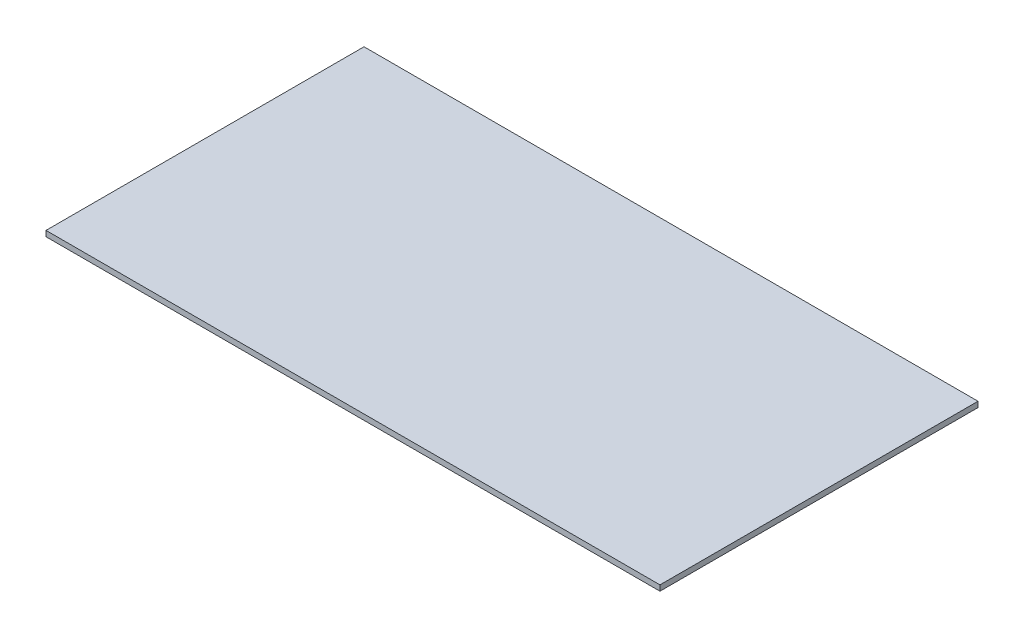
ISO-10303-21;
HEADER;
FILE_DESCRIPTION(('STEP AP214'),'2;1');
FILE_NAME('part.step','',(''),(''),'','','');
FILE_SCHEMA(('AUTOMOTIVE_DESIGN { 1 0 10303 214 1 1 1 1 }'));
ENDSEC;
DATA;
#1=APPLICATION_CONTEXT('core data for automotive mechanical design processes');
#2=APPLICATION_PROTOCOL_DEFINITION('international standard','automotive_design',2000,#1);
#3=PRODUCT_CONTEXT('',#1,'mechanical');
#4=PRODUCT('Part','Part','',(#3));
#5=PRODUCT_RELATED_PRODUCT_CATEGORY('part','',(#4));
#6=PRODUCT_DEFINITION_FORMATION('','',#4);
#7=PRODUCT_DEFINITION_CONTEXT('part definition',#1,'design');
#8=PRODUCT_DEFINITION('design','',#6,#7);
#9=PRODUCT_DEFINITION_SHAPE('','',#8);
#10=(LENGTH_UNIT() NAMED_UNIT(*) SI_UNIT(.MILLI.,.METRE.));
#11=(NAMED_UNIT(*) PLANE_ANGLE_UNIT() SI_UNIT($,.RADIAN.));
#12=(NAMED_UNIT(*) SI_UNIT($,.STERADIAN.) SOLID_ANGLE_UNIT());
#13=UNCERTAINTY_MEASURE_WITH_UNIT(LENGTH_MEASURE(1.E-05),#10,'distance_accuracy_value','');
#14=(GEOMETRIC_REPRESENTATION_CONTEXT(3) GLOBAL_UNCERTAINTY_ASSIGNED_CONTEXT((#13)) GLOBAL_UNIT_ASSIGNED_CONTEXT((#10,
#11,#12)) REPRESENTATION_CONTEXT('',''));
#15=CARTESIAN_POINT('',(0.,0.,0.));
#16=DIRECTION('',(0.,0.,1.));
#17=DIRECTION('',(1.,0.,0.));
#18=AXIS2_PLACEMENT_3D('',#15,#16,#17);
#19=CARTESIAN_POINT('',(0.,1.8,0.));
#20=DIRECTION('',(1.,0.,0.));
#21=DIRECTION('',(0.,0.,-1.));
#22=AXIS2_PLACEMENT_3D('',#19,#20,#21);
#23=PLANE('',#22);
#24=DIRECTION('',(0.,0.,1.));
#25=VECTOR('',#24,1.);
#26=CARTESIAN_POINT('',(0.,0.,0.));
#27=LINE('',#26,#25);
#28=CARTESIAN_POINT('',(0.,0.,-103.6));
#29=VERTEX_POINT('',#28);
#30=CARTESIAN_POINT('',(0.,0.,0.));
#31=VERTEX_POINT('',#30);
#32=EDGE_CURVE('E98',#29,#31,#27,.T.);
#33=ORIENTED_EDGE('',*,*,#32,.T.);
#34=DIRECTION('',(0.,-1.,0.));
#35=VECTOR('',#34,1.);
#36=CARTESIAN_POINT('',(0.,1.8,0.));
#37=LINE('',#36,#35);
#38=CARTESIAN_POINT('',(0.,1.8,0.));
#39=VERTEX_POINT('',#38);
#40=EDGE_CURVE('E11',#39,#31,#37,.T.);
#41=ORIENTED_EDGE('',*,*,#40,.F.);
#42=DIRECTION('',(0.,0.,1.));
#43=VECTOR('',#42,1.);
#44=CARTESIAN_POINT('',(0.,1.8,0.));
#45=LINE('',#44,#43);
#46=CARTESIAN_POINT('',(0.,1.8,-103.6));
#47=VERTEX_POINT('',#46);
#48=EDGE_CURVE('E86',#47,#39,#45,.T.);
#49=ORIENTED_EDGE('',*,*,#48,.F.);
#50=DIRECTION('',(0.,-1.,0.));
#51=VECTOR('',#50,1.);
#52=CARTESIAN_POINT('',(0.,1.8,-103.6));
#53=LINE('',#52,#51);
#54=EDGE_CURVE('E94',#47,#29,#53,.T.);
#55=ORIENTED_EDGE('',*,*,#54,.T.);
#56=EDGE_LOOP('',(#33,#41,#49,#55));
#57=FACE_BOUND('',#56,.T.);
#58=ADVANCED_FACE('F35',(#57),#23,.F.);
#59=CARTESIAN_POINT('',(0.,1.8,0.));
#60=DIRECTION('',(0.,0.,-1.));
#61=DIRECTION('',(-1.,0.,0.));
#62=AXIS2_PLACEMENT_3D('',#59,#60,#61);
#63=PLANE('',#62);
#64=DIRECTION('',(1.,0.,0.));
#65=VECTOR('',#64,1.);
#66=CARTESIAN_POINT('',(0.,0.,0.));
#67=LINE('',#66,#65);
#68=CARTESIAN_POINT('',(200.,0.,0.));
#69=VERTEX_POINT('',#68);
#70=EDGE_CURVE('E90',#31,#69,#67,.T.);
#71=ORIENTED_EDGE('',*,*,#70,.T.);
#72=DIRECTION('',(0.,-1.,0.));
#73=VECTOR('',#72,1.);
#74=CARTESIAN_POINT('',(200.,1.8,0.));
#75=LINE('',#74,#73);
#76=CARTESIAN_POINT('',(200.,1.8,0.));
#77=VERTEX_POINT('',#76);
#78=EDGE_CURVE('E43',#77,#69,#75,.T.);
#79=ORIENTED_EDGE('',*,*,#78,.F.);
#80=DIRECTION('',(1.,0.,0.));
#81=VECTOR('',#80,1.);
#82=CARTESIAN_POINT('',(0.,1.8,0.));
#83=LINE('',#82,#81);
#84=EDGE_CURVE('E81',#39,#77,#83,.T.);
#85=ORIENTED_EDGE('',*,*,#84,.F.);
#86=ORIENTED_EDGE('',*,*,#40,.T.);
#87=EDGE_LOOP('',(#71,#79,#85,#86));
#88=FACE_BOUND('',#87,.T.);
#89=ADVANCED_FACE('F89',(#88),#63,.F.);
#90=CARTESIAN_POINT('',(200.,1.8,0.));
#91=DIRECTION('',(-1.,0.,0.));
#92=DIRECTION('',(0.,0.,1.));
#93=AXIS2_PLACEMENT_3D('',#90,#91,#92);
#94=PLANE('',#93);
#95=DIRECTION('',(0.,0.,-1.));
#96=VECTOR('',#95,1.);
#97=CARTESIAN_POINT('',(200.,0.,0.));
#98=LINE('',#97,#96);
#99=CARTESIAN_POINT('',(200.,0.,-103.6));
#100=VERTEX_POINT('',#99);
#101=EDGE_CURVE('E68',#69,#100,#98,.T.);
#102=ORIENTED_EDGE('',*,*,#101,.T.);
#103=DIRECTION('',(0.,-1.,0.));
#104=VECTOR('',#103,1.);
#105=CARTESIAN_POINT('',(200.,1.8,-103.6));
#106=LINE('',#105,#104);
#107=CARTESIAN_POINT('',(200.,1.8,-103.6));
#108=VERTEX_POINT('',#107);
#109=EDGE_CURVE('E91',#108,#100,#106,.T.);
#110=ORIENTED_EDGE('',*,*,#109,.F.);
#111=DIRECTION('',(0.,0.,-1.));
#112=VECTOR('',#111,1.);
#113=CARTESIAN_POINT('',(200.,1.8,0.));
#114=LINE('',#113,#112);
#115=EDGE_CURVE('E84',#77,#108,#114,.T.);
#116=ORIENTED_EDGE('',*,*,#115,.F.);
#117=ORIENTED_EDGE('',*,*,#78,.T.);
#118=EDGE_LOOP('',(#102,#110,#116,#117));
#119=FACE_BOUND('',#118,.T.);
#120=ADVANCED_FACE('F92',(#119),#94,.F.);
#121=CARTESIAN_POINT('',(0.,1.8,-103.6));
#122=DIRECTION('',(0.,0.,1.));
#123=DIRECTION('',(1.,0.,0.));
#124=AXIS2_PLACEMENT_3D('',#121,#122,#123);
#125=PLANE('',#124);
#126=DIRECTION('',(-1.,0.,0.));
#127=VECTOR('',#126,1.);
#128=CARTESIAN_POINT('',(0.,0.,-103.6));
#129=LINE('',#128,#127);
#130=EDGE_CURVE('E74',#100,#29,#129,.T.);
#131=ORIENTED_EDGE('',*,*,#130,.T.);
#132=ORIENTED_EDGE('',*,*,#54,.F.);
#133=DIRECTION('',(-1.,0.,0.));
#134=VECTOR('',#133,1.);
#135=CARTESIAN_POINT('',(0.,1.8,-103.6));
#136=LINE('',#135,#134);
#137=EDGE_CURVE('E51',#108,#47,#136,.T.);
#138=ORIENTED_EDGE('',*,*,#137,.F.);
#139=ORIENTED_EDGE('',*,*,#109,.T.);
#140=EDGE_LOOP('',(#131,#132,#138,#139));
#141=FACE_BOUND('',#140,.T.);
#142=ADVANCED_FACE('F105',(#141),#125,.F.);
#143=CARTESIAN_POINT('',(0.,1.8,0.));
#144=DIRECTION('',(0.,-1.,0.));
#145=DIRECTION('',(0.,0.,-1.));
#146=AXIS2_PLACEMENT_3D('',#143,#144,#145);
#147=PLANE('',#146);
#148=ORIENTED_EDGE('',*,*,#48,.T.);
#149=ORIENTED_EDGE('',*,*,#84,.T.);
#150=ORIENTED_EDGE('',*,*,#115,.T.);
#151=ORIENTED_EDGE('',*,*,#137,.T.);
#152=EDGE_LOOP('',(#148,#149,#150,#151));
#153=FACE_BOUND('',#152,.T.);
#154=ADVANCED_FACE('F82',(#153),#147,.F.);
#155=CARTESIAN_POINT('',(0.,0.,0.));
#156=DIRECTION('',(0.,-1.,0.));
#157=DIRECTION('',(0.,0.,-1.));
#158=AXIS2_PLACEMENT_3D('',#155,#156,#157);
#159=PLANE('',#158);
#160=ORIENTED_EDGE('',*,*,#32,.F.);
#161=ORIENTED_EDGE('',*,*,#130,.F.);
#162=ORIENTED_EDGE('',*,*,#101,.F.);
#163=ORIENTED_EDGE('',*,*,#70,.F.);
#164=EDGE_LOOP('',(#160,#161,#162,#163));
#165=FACE_BOUND('',#164,.T.);
#166=ADVANCED_FACE('F108',(#165),#159,.T.);
#167=CLOSED_SHELL('',(#58,#89,#120,#142,#154,#166));
#168=MANIFOLD_SOLID_BREP('B2',#167);
#169=ADVANCED_BREP_SHAPE_REPRESENTATION('',(#18,#168),#14);
#170=SHAPE_DEFINITION_REPRESENTATION(#9,#169);
ENDSEC;
END-ISO-10303-21;
